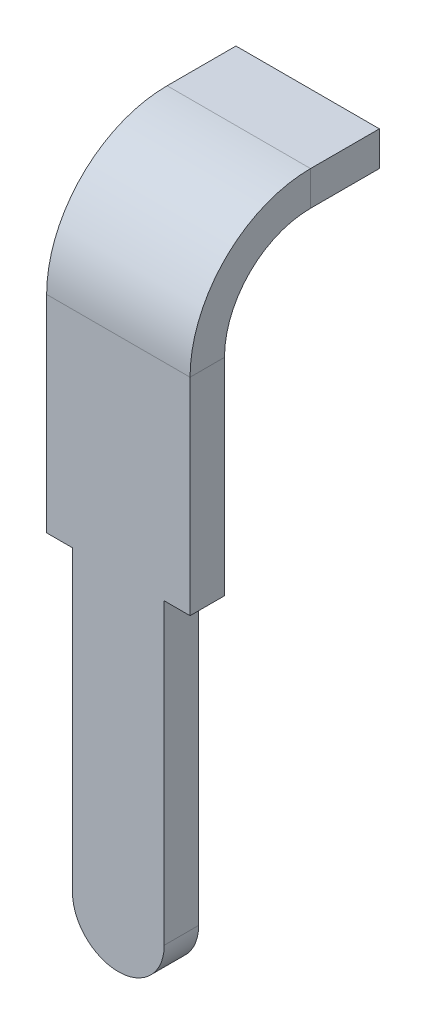
ISO-10303-21;
HEADER;
FILE_DESCRIPTION(('STEP AP214'),'2;1');
FILE_NAME('part.step','',(''),(''),'','','');
FILE_SCHEMA(('AUTOMOTIVE_DESIGN { 1 0 10303 214 1 1 1 1 }'));
ENDSEC;
DATA;
#1=APPLICATION_CONTEXT('core data for automotive mechanical design processes');
#2=APPLICATION_PROTOCOL_DEFINITION('international standard','automotive_design',2000,#1);
#3=PRODUCT_CONTEXT('',#1,'mechanical');
#4=PRODUCT('Part','Part','',(#3));
#5=PRODUCT_RELATED_PRODUCT_CATEGORY('part','',(#4));
#6=PRODUCT_DEFINITION_FORMATION('','',#4);
#7=PRODUCT_DEFINITION_CONTEXT('part definition',#1,'design');
#8=PRODUCT_DEFINITION('design','',#6,#7);
#9=PRODUCT_DEFINITION_SHAPE('','',#8);
#10=(LENGTH_UNIT() NAMED_UNIT(*) SI_UNIT(.MILLI.,.METRE.));
#11=(NAMED_UNIT(*) PLANE_ANGLE_UNIT() SI_UNIT($,.RADIAN.));
#12=(NAMED_UNIT(*) SI_UNIT($,.STERADIAN.) SOLID_ANGLE_UNIT());
#13=UNCERTAINTY_MEASURE_WITH_UNIT(LENGTH_MEASURE(1.E-05),#10,'distance_accuracy_value','');
#14=(GEOMETRIC_REPRESENTATION_CONTEXT(3) GLOBAL_UNCERTAINTY_ASSIGNED_CONTEXT((#13)) GLOBAL_UNIT_ASSIGNED_CONTEXT((#10,
#11,#12)) REPRESENTATION_CONTEXT('',''));
#15=CARTESIAN_POINT('',(0.,0.,0.));
#16=DIRECTION('',(0.,0.,1.));
#17=DIRECTION('',(1.,0.,0.));
#18=AXIS2_PLACEMENT_3D('',#15,#16,#17);
#19=CARTESIAN_POINT('',(2.5,-4.3,6.));
#20=DIRECTION('',(0.,0.,1.));
#21=DIRECTION('',(0.,-1.,0.));
#22=AXIS2_PLACEMENT_3D('',#19,#20,#21);
#23=CYLINDRICAL_SURFACE('',#22,0.4);
#24=CARTESIAN_POINT('',(2.5,-4.3,6.85));
#25=DIRECTION('',(0.,0.,-1.));
#26=DIRECTION('',(-1.,0.,0.));
#27=AXIS2_PLACEMENT_3D('',#24,#25,#26);
#28=CIRCLE('',#27,0.4);
#29=CARTESIAN_POINT('',(2.9,-4.3,6.85));
#30=VERTEX_POINT('',#29);
#31=CARTESIAN_POINT('',(2.5,-4.7,6.85));
#32=VERTEX_POINT('',#31);
#33=EDGE_CURVE('E338',#30,#32,#28,.T.);
#34=ORIENTED_EDGE('',*,*,#33,.F.);
#35=DIRECTION('',(0.,0.,-1.));
#36=VECTOR('',#35,1.);
#37=CARTESIAN_POINT('',(2.9,-4.3,-5.5));
#38=LINE('',#37,#36);
#39=CARTESIAN_POINT('',(2.9,-4.3,7.15));
#40=VERTEX_POINT('',#39);
#41=EDGE_CURVE('E256',#40,#30,#38,.T.);
#42=ORIENTED_EDGE('',*,*,#41,.F.);
#43=CARTESIAN_POINT('',(2.5,-4.3,7.15));
#44=DIRECTION('',(0.,0.,1.));
#45=DIRECTION('',(1.,0.,0.));
#46=AXIS2_PLACEMENT_3D('',#43,#44,#45);
#47=CIRCLE('',#46,0.4);
#48=CARTESIAN_POINT('',(2.5,-4.7,7.15));
#49=VERTEX_POINT('',#48);
#50=EDGE_CURVE('E185',#49,#40,#47,.T.);
#51=ORIENTED_EDGE('',*,*,#50,.F.);
#52=DIRECTION('',(0.,0.,-1.));
#53=VECTOR('',#52,1.);
#54=CARTESIAN_POINT('',(2.5,-4.7,6.));
#55=LINE('',#54,#53);
#56=EDGE_CURVE('E11',#49,#32,#55,.T.);
#57=ORIENTED_EDGE('',*,*,#56,.T.);
#58=EDGE_LOOP('',(#34,#42,#51,#57));
#59=FACE_BOUND('',#58,.T.);
#60=ADVANCED_FACE('F17',(#59),#23,.T.);
#61=CARTESIAN_POINT('',(2.5,-4.3,6.));
#62=DIRECTION('',(0.,0.,-1.));
#63=DIRECTION('',(0.,1.,0.));
#64=AXIS2_PLACEMENT_3D('',#61,#62,#63);
#65=CYLINDRICAL_SURFACE('',#64,0.4);
#66=DIRECTION('',(0.,0.,1.));
#67=VECTOR('',#66,1.);
#68=CARTESIAN_POINT('',(2.1,-4.3,-5.5));
#69=LINE('',#68,#67);
#70=CARTESIAN_POINT('',(2.1,-4.3,6.85));
#71=VERTEX_POINT('',#70);
#72=CARTESIAN_POINT('',(2.1,-4.3,7.15));
#73=VERTEX_POINT('',#72);
#74=EDGE_CURVE('E26',#71,#73,#69,.T.);
#75=ORIENTED_EDGE('',*,*,#74,.F.);
#76=CARTESIAN_POINT('',(2.5,-4.3,6.85));
#77=DIRECTION('',(0.,0.,-1.));
#78=DIRECTION('',(-1.,0.,0.));
#79=AXIS2_PLACEMENT_3D('',#76,#77,#78);
#80=CIRCLE('',#79,0.4);
#81=EDGE_CURVE('E303',#32,#71,#80,.T.);
#82=ORIENTED_EDGE('',*,*,#81,.F.);
#83=ORIENTED_EDGE('',*,*,#56,.F.);
#84=CARTESIAN_POINT('',(2.5,-4.3,7.15));
#85=DIRECTION('',(0.,0.,1.));
#86=DIRECTION('',(1.,0.,0.));
#87=AXIS2_PLACEMENT_3D('',#84,#85,#86);
#88=CIRCLE('',#87,0.4);
#89=EDGE_CURVE('E168',#73,#49,#88,.T.);
#90=ORIENTED_EDGE('',*,*,#89,.F.);
#91=EDGE_LOOP('',(#75,#82,#83,#90));
#92=FACE_BOUND('',#91,.T.);
#93=ADVANCED_FACE('F365',(#92),#65,.T.);
#94=CARTESIAN_POINT('',(2.1,-4.7,-5.5));
#95=DIRECTION('',(1.,0.,0.));
#96=DIRECTION('',(0.,1.,0.));
#97=AXIS2_PLACEMENT_3D('',#94,#95,#96);
#98=PLANE('',#97);
#99=DIRECTION('',(0.,-1.,0.));
#100=VECTOR('',#99,1.);
#101=CARTESIAN_POINT('',(2.1,0.1,6.85));
#102=LINE('',#101,#100);
#103=CARTESIAN_POINT('',(2.1,-1.7,6.85));
#104=VERTEX_POINT('',#103);
#105=EDGE_CURVE('E298',#104,#71,#102,.T.);
#106=ORIENTED_EDGE('',*,*,#105,.T.);
#107=ORIENTED_EDGE('',*,*,#74,.T.);
#108=DIRECTION('',(0.,1.,0.));
#109=VECTOR('',#108,1.);
#110=CARTESIAN_POINT('',(2.1,-4.7,7.15));
#111=LINE('',#110,#109);
#112=CARTESIAN_POINT('',(2.1,-1.7,7.15));
#113=VERTEX_POINT('',#112);
#114=EDGE_CURVE('E209',#73,#113,#111,.T.);
#115=ORIENTED_EDGE('',*,*,#114,.T.);
#116=DIRECTION('',(0.,0.,1.));
#117=VECTOR('',#116,1.);
#118=CARTESIAN_POINT('',(2.1,-1.7,-5.5));
#119=LINE('',#118,#117);
#120=EDGE_CURVE('E20',#104,#113,#119,.T.);
#121=ORIENTED_EDGE('',*,*,#120,.F.);
#122=EDGE_LOOP('',(#106,#107,#115,#121));
#123=FACE_BOUND('',#122,.T.);
#124=ADVANCED_FACE('F277',(#123),#98,.F.);
#125=CARTESIAN_POINT('',(1.875,-1.7,-5.5));
#126=DIRECTION('',(0.,1.,0.));
#127=DIRECTION('',(1.,0.,0.));
#128=AXIS2_PLACEMENT_3D('',#125,#126,#127);
#129=PLANE('',#128);
#130=DIRECTION('',(1.,0.,0.));
#131=VECTOR('',#130,1.);
#132=CARTESIAN_POINT('',(1.875,-1.7,6.85));
#133=LINE('',#132,#131);
#134=CARTESIAN_POINT('',(1.875,-1.7,6.85));
#135=VERTEX_POINT('',#134);
#136=EDGE_CURVE('E272',#135,#104,#133,.T.);
#137=ORIENTED_EDGE('',*,*,#136,.T.);
#138=ORIENTED_EDGE('',*,*,#120,.T.);
#139=DIRECTION('',(-1.,0.,0.));
#140=VECTOR('',#139,1.);
#141=CARTESIAN_POINT('',(1.875,-1.7,7.15));
#142=LINE('',#141,#140);
#143=CARTESIAN_POINT('',(1.875,-1.7,7.15));
#144=VERTEX_POINT('',#143);
#145=EDGE_CURVE('E205',#113,#144,#142,.T.);
#146=ORIENTED_EDGE('',*,*,#145,.T.);
#147=DIRECTION('',(0.,0.,1.));
#148=VECTOR('',#147,1.);
#149=CARTESIAN_POINT('',(1.875,-1.7,-5.5));
#150=LINE('',#149,#148);
#151=EDGE_CURVE('E210',#135,#144,#150,.T.);
#152=ORIENTED_EDGE('',*,*,#151,.F.);
#153=EDGE_LOOP('',(#137,#138,#146,#152));
#154=FACE_BOUND('',#153,.T.);
#155=ADVANCED_FACE('F269',(#154),#129,.F.);
#156=CARTESIAN_POINT('',(3.125,-1.7,-5.5));
#157=DIRECTION('',(0.,1.,0.));
#158=DIRECTION('',(1.,0.,0.));
#159=AXIS2_PLACEMENT_3D('',#156,#157,#158);
#160=PLANE('',#159);
#161=DIRECTION('',(1.,0.,0.));
#162=VECTOR('',#161,1.);
#163=CARTESIAN_POINT('',(1.875,-1.7,6.85));
#164=LINE('',#163,#162);
#165=CARTESIAN_POINT('',(2.9,-1.7,6.85));
#166=VERTEX_POINT('',#165);
#167=CARTESIAN_POINT('',(3.125,-1.7,6.85));
#168=VERTEX_POINT('',#167);
#169=EDGE_CURVE('E172',#166,#168,#164,.T.);
#170=ORIENTED_EDGE('',*,*,#169,.T.);
#171=DIRECTION('',(0.,0.,1.));
#172=VECTOR('',#171,1.);
#173=CARTESIAN_POINT('',(3.125,-1.7,-5.5));
#174=LINE('',#173,#172);
#175=CARTESIAN_POINT('',(3.125,-1.7,7.15));
#176=VERTEX_POINT('',#175);
#177=EDGE_CURVE('E163',#168,#176,#174,.T.);
#178=ORIENTED_EDGE('',*,*,#177,.T.);
#179=DIRECTION('',(-1.,0.,0.));
#180=VECTOR('',#179,1.);
#181=CARTESIAN_POINT('',(3.125,-1.7,7.15));
#182=LINE('',#181,#180);
#183=CARTESIAN_POINT('',(2.9,-1.7,7.15));
#184=VERTEX_POINT('',#183);
#185=EDGE_CURVE('E145',#176,#184,#182,.T.);
#186=ORIENTED_EDGE('',*,*,#185,.T.);
#187=DIRECTION('',(0.,0.,1.));
#188=VECTOR('',#187,1.);
#189=CARTESIAN_POINT('',(2.9,-1.7,-5.5));
#190=LINE('',#189,#188);
#191=EDGE_CURVE('E258',#166,#184,#190,.T.);
#192=ORIENTED_EDGE('',*,*,#191,.F.);
#193=EDGE_LOOP('',(#170,#178,#186,#192));
#194=FACE_BOUND('',#193,.T.);
#195=ADVANCED_FACE('F170',(#194),#160,.F.);
#196=CARTESIAN_POINT('',(2.9,-4.7,-5.5));
#197=DIRECTION('',(-1.,0.,0.));
#198=DIRECTION('',(0.,0.,1.));
#199=AXIS2_PLACEMENT_3D('',#196,#197,#198);
#200=PLANE('',#199);
#201=DIRECTION('',(0.,-1.,0.));
#202=VECTOR('',#201,1.);
#203=CARTESIAN_POINT('',(2.9,-4.7,7.15));
#204=LINE('',#203,#202);
#205=EDGE_CURVE('E154',#184,#40,#204,.T.);
#206=ORIENTED_EDGE('',*,*,#205,.T.);
#207=ORIENTED_EDGE('',*,*,#41,.T.);
#208=DIRECTION('',(0.,1.,0.));
#209=VECTOR('',#208,1.);
#210=CARTESIAN_POINT('',(2.9,0.1,6.85));
#211=LINE('',#210,#209);
#212=EDGE_CURVE('E335',#30,#166,#211,.T.);
#213=ORIENTED_EDGE('',*,*,#212,.T.);
#214=ORIENTED_EDGE('',*,*,#191,.T.);
#215=EDGE_LOOP('',(#206,#207,#213,#214));
#216=FACE_BOUND('',#215,.T.);
#217=ADVANCED_FACE('F355',(#216),#200,.F.);
#218=CARTESIAN_POINT('',(0.,0.,5.5));
#219=DIRECTION('',(0.,0.,-1.));
#220=DIRECTION('',(0.,-1.,0.));
#221=AXIS2_PLACEMENT_3D('',#218,#219,#220);
#222=PLANE('',#221);
#223=DIRECTION('',(0.,-1.,0.));
#224=VECTOR('',#223,1.);
#225=CARTESIAN_POINT('',(1.875,0.85,5.5));
#226=LINE('',#225,#224);
#227=CARTESIAN_POINT('',(1.875,1.15,5.5));
#228=VERTEX_POINT('',#227);
#229=CARTESIAN_POINT('',(1.875,0.85,5.5));
#230=VERTEX_POINT('',#229);
#231=EDGE_CURVE('E236',#228,#230,#226,.T.);
#232=ORIENTED_EDGE('',*,*,#231,.F.);
#233=DIRECTION('',(-1.,0.,0.));
#234=VECTOR('',#233,1.);
#235=CARTESIAN_POINT('',(1.875,1.15,5.5));
#236=LINE('',#235,#234);
#237=CARTESIAN_POINT('',(3.125,1.15,5.5));
#238=VERTEX_POINT('',#237);
#239=EDGE_CURVE('E39',#238,#228,#236,.T.);
#240=ORIENTED_EDGE('',*,*,#239,.F.);
#241=DIRECTION('',(0.,1.,0.));
#242=VECTOR('',#241,1.);
#243=CARTESIAN_POINT('',(3.125,0.85,5.5));
#244=LINE('',#243,#242);
#245=CARTESIAN_POINT('',(3.125,0.85,5.5));
#246=VERTEX_POINT('',#245);
#247=EDGE_CURVE('E46',#246,#238,#244,.T.);
#248=ORIENTED_EDGE('',*,*,#247,.F.);
#249=DIRECTION('',(1.,0.,0.));
#250=VECTOR('',#249,1.);
#251=CARTESIAN_POINT('',(1.875,0.85,5.5));
#252=LINE('',#251,#250);
#253=EDGE_CURVE('E245',#230,#246,#252,.T.);
#254=ORIENTED_EDGE('',*,*,#253,.F.);
#255=EDGE_LOOP('',(#232,#240,#248,#254));
#256=FACE_BOUND('',#255,.T.);
#257=ADVANCED_FACE('F353',(#256),#222,.T.);
#258=CARTESIAN_POINT('',(1.875,1.15,6.1));
#259=DIRECTION('',(0.,-1.,0.));
#260=DIRECTION('',(0.,0.,-1.));
#261=AXIS2_PLACEMENT_3D('',#258,#259,#260);
#262=PLANE('',#261);
#263=ORIENTED_EDGE('',*,*,#239,.T.);
#264=DIRECTION('',(0.,0.,-1.));
#265=VECTOR('',#264,1.);
#266=CARTESIAN_POINT('',(1.875,1.15,6.1));
#267=LINE('',#266,#265);
#268=CARTESIAN_POINT('',(1.875,1.15,6.1));
#269=VERTEX_POINT('',#268);
#270=EDGE_CURVE('E241',#269,#228,#267,.T.);
#271=ORIENTED_EDGE('',*,*,#270,.F.);
#272=DIRECTION('',(-1.,0.,0.));
#273=VECTOR('',#272,1.);
#274=CARTESIAN_POINT('',(1.875,1.15,6.1));
#275=LINE('',#274,#273);
#276=CARTESIAN_POINT('',(3.125,1.15,6.1));
#277=VERTEX_POINT('',#276);
#278=EDGE_CURVE('E200',#277,#269,#275,.T.);
#279=ORIENTED_EDGE('',*,*,#278,.F.);
#280=DIRECTION('',(0.,0.,-1.));
#281=VECTOR('',#280,1.);
#282=CARTESIAN_POINT('',(3.125,1.15,6.1));
#283=LINE('',#282,#281);
#284=EDGE_CURVE('E189',#277,#238,#283,.T.);
#285=ORIENTED_EDGE('',*,*,#284,.T.);
#286=EDGE_LOOP('',(#263,#271,#279,#285));
#287=FACE_BOUND('',#286,.T.);
#288=ADVANCED_FACE('F350',(#287),#262,.F.);
#289=CARTESIAN_POINT('',(3.125,0.85,6.1));
#290=DIRECTION('',(-1.,0.,0.));
#291=DIRECTION('',(0.,0.,1.));
#292=AXIS2_PLACEMENT_3D('',#289,#290,#291);
#293=PLANE('',#292);
#294=ORIENTED_EDGE('',*,*,#247,.T.);
#295=ORIENTED_EDGE('',*,*,#284,.F.);
#296=DIRECTION('',(0.,1.,0.));
#297=VECTOR('',#296,1.);
#298=CARTESIAN_POINT('',(3.125,0.85,6.1));
#299=LINE('',#298,#297);
#300=CARTESIAN_POINT('',(3.125,0.85,6.1));
#301=VERTEX_POINT('',#300);
#302=EDGE_CURVE('E201',#301,#277,#299,.T.);
#303=ORIENTED_EDGE('',*,*,#302,.F.);
#304=DIRECTION('',(0.,0.,-1.));
#305=VECTOR('',#304,1.);
#306=CARTESIAN_POINT('',(3.125,0.85,6.1));
#307=LINE('',#306,#305);
#308=EDGE_CURVE('E249',#301,#246,#307,.T.);
#309=ORIENTED_EDGE('',*,*,#308,.T.);
#310=EDGE_LOOP('',(#294,#295,#303,#309));
#311=FACE_BOUND('',#310,.T.);
#312=ADVANCED_FACE('F324',(#311),#293,.F.);
#313=CARTESIAN_POINT('',(1.875,0.85,6.1));
#314=DIRECTION('',(0.,1.,0.));
#315=DIRECTION('',(1.,0.,0.));
#316=AXIS2_PLACEMENT_3D('',#313,#314,#315);
#317=PLANE('',#316);
#318=ORIENTED_EDGE('',*,*,#253,.T.);
#319=ORIENTED_EDGE('',*,*,#308,.F.);
#320=DIRECTION('',(1.,0.,0.));
#321=VECTOR('',#320,1.);
#322=CARTESIAN_POINT('',(1.875,0.85,6.1));
#323=LINE('',#322,#321);
#324=CARTESIAN_POINT('',(1.875,0.85,6.1));
#325=VERTEX_POINT('',#324);
#326=EDGE_CURVE('E218',#325,#301,#323,.T.);
#327=ORIENTED_EDGE('',*,*,#326,.F.);
#328=DIRECTION('',(0.,0.,-1.));
#329=VECTOR('',#328,1.);
#330=CARTESIAN_POINT('',(1.875,0.85,6.1));
#331=LINE('',#330,#329);
#332=EDGE_CURVE('E240',#325,#230,#331,.T.);
#333=ORIENTED_EDGE('',*,*,#332,.T.);
#334=EDGE_LOOP('',(#318,#319,#327,#333));
#335=FACE_BOUND('',#334,.T.);
#336=ADVANCED_FACE('F320',(#335),#317,.F.);
#337=CARTESIAN_POINT('',(1.875,0.85,6.1));
#338=DIRECTION('',(1.,0.,0.));
#339=DIRECTION('',(0.,1.,0.));
#340=AXIS2_PLACEMENT_3D('',#337,#338,#339);
#341=PLANE('',#340);
#342=ORIENTED_EDGE('',*,*,#231,.T.);
#343=ORIENTED_EDGE('',*,*,#332,.F.);
#344=DIRECTION('',(0.,-1.,0.));
#345=VECTOR('',#344,1.);
#346=CARTESIAN_POINT('',(1.875,0.85,6.1));
#347=LINE('',#346,#345);
#348=EDGE_CURVE('E232',#269,#325,#347,.T.);
#349=ORIENTED_EDGE('',*,*,#348,.F.);
#350=ORIENTED_EDGE('',*,*,#270,.T.);
#351=EDGE_LOOP('',(#342,#343,#349,#350));
#352=FACE_BOUND('',#351,.T.);
#353=ADVANCED_FACE('F352',(#352),#341,.F.);
#354=CARTESIAN_POINT('',(1.875,0.85,6.1));
#355=DIRECTION('',(-1.,0.,0.));
#356=DIRECTION('',(0.,0.,1.));
#357=AXIS2_PLACEMENT_3D('',#354,#355,#356);
#358=PLANE('',#357);
#359=ORIENTED_EDGE('',*,*,#348,.T.);
#360=CARTESIAN_POINT('',(1.875,0.1,6.1));
#361=DIRECTION('',(1.,0.,0.));
#362=DIRECTION('',(0.,0.,-1.));
#363=AXIS2_PLACEMENT_3D('',#360,#361,#362);
#364=CIRCLE('',#363,0.75);
#365=CARTESIAN_POINT('',(1.875,0.1,6.85));
#366=VERTEX_POINT('',#365);
#367=EDGE_CURVE('E217',#325,#366,#364,.T.);
#368=ORIENTED_EDGE('',*,*,#367,.T.);
#369=DIRECTION('',(0.,0.,-1.));
#370=VECTOR('',#369,1.);
#371=CARTESIAN_POINT('',(1.875,0.1,6.85));
#372=LINE('',#371,#370);
#373=CARTESIAN_POINT('',(1.875,0.09999999999999,7.15));
#374=VERTEX_POINT('',#373);
#375=EDGE_CURVE('E213',#374,#366,#372,.T.);
#376=ORIENTED_EDGE('',*,*,#375,.F.);
#377=CARTESIAN_POINT('',(1.875,0.1,6.1));
#378=DIRECTION('',(1.,0.,0.));
#379=DIRECTION('',(0.,0.,-1.));
#380=AXIS2_PLACEMENT_3D('',#377,#378,#379);
#381=CIRCLE('',#380,1.05);
#382=EDGE_CURVE('E231',#269,#374,#381,.T.);
#383=ORIENTED_EDGE('',*,*,#382,.F.);
#384=EDGE_LOOP('',(#359,#368,#376,#383));
#385=FACE_BOUND('',#384,.T.);
#386=ADVANCED_FACE('F312',(#385),#358,.T.);
#387=CARTESIAN_POINT('',(0.,0.1,6.1));
#388=DIRECTION('',(1.,0.,0.));
#389=DIRECTION('',(0.,0.,-1.));
#390=AXIS2_PLACEMENT_3D('',#387,#388,#389);
#391=CYLINDRICAL_SURFACE('',#390,1.05);
#392=ORIENTED_EDGE('',*,*,#278,.T.);
#393=ORIENTED_EDGE('',*,*,#382,.T.);
#394=DIRECTION('',(-1.,0.,0.));
#395=VECTOR('',#394,1.);
#396=CARTESIAN_POINT('',(1.875,0.09999999999999,7.15));
#397=LINE('',#396,#395);
#398=CARTESIAN_POINT('',(3.125,0.09999999999999,7.15));
#399=VERTEX_POINT('',#398);
#400=EDGE_CURVE('E158',#399,#374,#397,.T.);
#401=ORIENTED_EDGE('',*,*,#400,.F.);
#402=CARTESIAN_POINT('',(3.125,0.1,6.1));
#403=DIRECTION('',(1.,0.,0.));
#404=DIRECTION('',(0.,0.,-1.));
#405=AXIS2_PLACEMENT_3D('',#402,#403,#404);
#406=CIRCLE('',#405,1.05);
#407=EDGE_CURVE('E197',#277,#399,#406,.T.);
#408=ORIENTED_EDGE('',*,*,#407,.F.);
#409=EDGE_LOOP('',(#392,#393,#401,#408));
#410=FACE_BOUND('',#409,.T.);
#411=ADVANCED_FACE('F348',(#410),#391,.T.);
#412=CARTESIAN_POINT('',(3.125,0.85,6.1));
#413=DIRECTION('',(1.,0.,0.));
#414=DIRECTION('',(0.,1.,0.));
#415=AXIS2_PLACEMENT_3D('',#412,#413,#414);
#416=PLANE('',#415);
#417=ORIENTED_EDGE('',*,*,#302,.T.);
#418=ORIENTED_EDGE('',*,*,#407,.T.);
#419=DIRECTION('',(0.,0.,1.));
#420=VECTOR('',#419,1.);
#421=CARTESIAN_POINT('',(3.125,0.1,6.85));
#422=LINE('',#421,#420);
#423=CARTESIAN_POINT('',(3.125,0.1,6.85));
#424=VERTEX_POINT('',#423);
#425=EDGE_CURVE('E166',#424,#399,#422,.T.);
#426=ORIENTED_EDGE('',*,*,#425,.F.);
#427=CARTESIAN_POINT('',(3.125,0.1,6.1));
#428=DIRECTION('',(1.,0.,0.));
#429=DIRECTION('',(0.,0.,-1.));
#430=AXIS2_PLACEMENT_3D('',#427,#428,#429);
#431=CIRCLE('',#430,0.75);
#432=EDGE_CURVE('E214',#301,#424,#431,.T.);
#433=ORIENTED_EDGE('',*,*,#432,.F.);
#434=EDGE_LOOP('',(#417,#418,#426,#433));
#435=FACE_BOUND('',#434,.T.);
#436=ADVANCED_FACE('F327',(#435),#416,.T.);
#437=CARTESIAN_POINT('',(0.,0.1,6.1));
#438=DIRECTION('',(1.,0.,0.));
#439=DIRECTION('',(0.,0.,-1.));
#440=AXIS2_PLACEMENT_3D('',#437,#438,#439);
#441=CYLINDRICAL_SURFACE('',#440,0.75);
#442=ORIENTED_EDGE('',*,*,#326,.T.);
#443=ORIENTED_EDGE('',*,*,#432,.T.);
#444=DIRECTION('',(1.,0.,0.));
#445=VECTOR('',#444,1.);
#446=CARTESIAN_POINT('',(1.875,0.1,6.85));
#447=LINE('',#446,#445);
#448=EDGE_CURVE('E293',#366,#424,#447,.T.);
#449=ORIENTED_EDGE('',*,*,#448,.F.);
#450=ORIENTED_EDGE('',*,*,#367,.F.);
#451=EDGE_LOOP('',(#442,#443,#449,#450));
#452=FACE_BOUND('',#451,.T.);
#453=ADVANCED_FACE('F317',(#452),#441,.F.);
#454=CARTESIAN_POINT('',(1.875,0.1,6.85));
#455=DIRECTION('',(-1.,0.,0.));
#456=DIRECTION('',(0.,0.,1.));
#457=AXIS2_PLACEMENT_3D('',#454,#455,#456);
#458=PLANE('',#457);
#459=ORIENTED_EDGE('',*,*,#151,.T.);
#460=DIRECTION('',(0.,-1.,0.));
#461=VECTOR('',#460,1.);
#462=CARTESIAN_POINT('',(1.875,0.09999999999999,7.15));
#463=LINE('',#462,#461);
#464=EDGE_CURVE('E194',#374,#144,#463,.T.);
#465=ORIENTED_EDGE('',*,*,#464,.F.);
#466=ORIENTED_EDGE('',*,*,#375,.T.);
#467=DIRECTION('',(0.,-1.,0.));
#468=VECTOR('',#467,1.);
#469=CARTESIAN_POINT('',(1.875,0.1,6.85));
#470=LINE('',#469,#468);
#471=EDGE_CURVE('E289',#366,#135,#470,.T.);
#472=ORIENTED_EDGE('',*,*,#471,.T.);
#473=EDGE_LOOP('',(#459,#465,#466,#472));
#474=FACE_BOUND('',#473,.T.);
#475=ADVANCED_FACE('F284',(#474),#458,.T.);
#476=CARTESIAN_POINT('',(1.875,0.09999999999999,7.15));
#477=DIRECTION('',(0.,0.,1.));
#478=DIRECTION('',(1.,0.,0.));
#479=AXIS2_PLACEMENT_3D('',#476,#477,#478);
#480=PLANE('',#479);
#481=ORIENTED_EDGE('',*,*,#89,.T.);
#482=ORIENTED_EDGE('',*,*,#50,.T.);
#483=ORIENTED_EDGE('',*,*,#205,.F.);
#484=ORIENTED_EDGE('',*,*,#185,.F.);
#485=DIRECTION('',(0.,-1.,0.));
#486=VECTOR('',#485,1.);
#487=CARTESIAN_POINT('',(3.125,0.09999999999999,7.15));
#488=LINE('',#487,#486);
#489=EDGE_CURVE('E150',#399,#176,#488,.T.);
#490=ORIENTED_EDGE('',*,*,#489,.F.);
#491=ORIENTED_EDGE('',*,*,#400,.T.);
#492=ORIENTED_EDGE('',*,*,#464,.T.);
#493=ORIENTED_EDGE('',*,*,#145,.F.);
#494=ORIENTED_EDGE('',*,*,#114,.F.);
#495=EDGE_LOOP('',(#481,#482,#483,#484,#490,#491,#492,#493,#494));
#496=FACE_BOUND('',#495,.T.);
#497=ADVANCED_FACE('F148',(#496),#480,.T.);
#498=CARTESIAN_POINT('',(3.125,0.1,6.85));
#499=DIRECTION('',(1.,0.,0.));
#500=DIRECTION('',(0.,1.,0.));
#501=AXIS2_PLACEMENT_3D('',#498,#499,#500);
#502=PLANE('',#501);
#503=ORIENTED_EDGE('',*,*,#177,.F.);
#504=DIRECTION('',(0.,-1.,0.));
#505=VECTOR('',#504,1.);
#506=CARTESIAN_POINT('',(3.125,0.1,6.85));
#507=LINE('',#506,#505);
#508=EDGE_CURVE('E181',#424,#168,#507,.T.);
#509=ORIENTED_EDGE('',*,*,#508,.F.);
#510=ORIENTED_EDGE('',*,*,#425,.T.);
#511=ORIENTED_EDGE('',*,*,#489,.T.);
#512=EDGE_LOOP('',(#503,#509,#510,#511));
#513=FACE_BOUND('',#512,.T.);
#514=ADVANCED_FACE('F161',(#513),#502,.T.);
#515=CARTESIAN_POINT('',(1.875,0.1,6.85));
#516=DIRECTION('',(0.,0.,-1.));
#517=DIRECTION('',(0.,-1.,0.));
#518=AXIS2_PLACEMENT_3D('',#515,#516,#517);
#519=PLANE('',#518);
#520=ORIENTED_EDGE('',*,*,#212,.F.);
#521=ORIENTED_EDGE('',*,*,#33,.T.);
#522=ORIENTED_EDGE('',*,*,#81,.T.);
#523=ORIENTED_EDGE('',*,*,#105,.F.);
#524=ORIENTED_EDGE('',*,*,#136,.F.);
#525=ORIENTED_EDGE('',*,*,#471,.F.);
#526=ORIENTED_EDGE('',*,*,#448,.T.);
#527=ORIENTED_EDGE('',*,*,#508,.T.);
#528=ORIENTED_EDGE('',*,*,#169,.F.);
#529=EDGE_LOOP('',(#520,#521,#522,#523,#524,#525,#526,#527,#528));
#530=FACE_BOUND('',#529,.T.);
#531=ADVANCED_FACE('F296',(#530),#519,.T.);
#532=CLOSED_SHELL('',(#60,#93,#124,#155,#195,#217,#257,#288,#312,#336,#353,#386,#411,#436,#453,
#475,#497,#514,#531));
#533=MANIFOLD_SOLID_BREP('B1',#532);
#534=ADVANCED_BREP_SHAPE_REPRESENTATION('',(#18,#533),#14);
#535=SHAPE_DEFINITION_REPRESENTATION(#9,#534);
ENDSEC;
END-ISO-10303-21;
